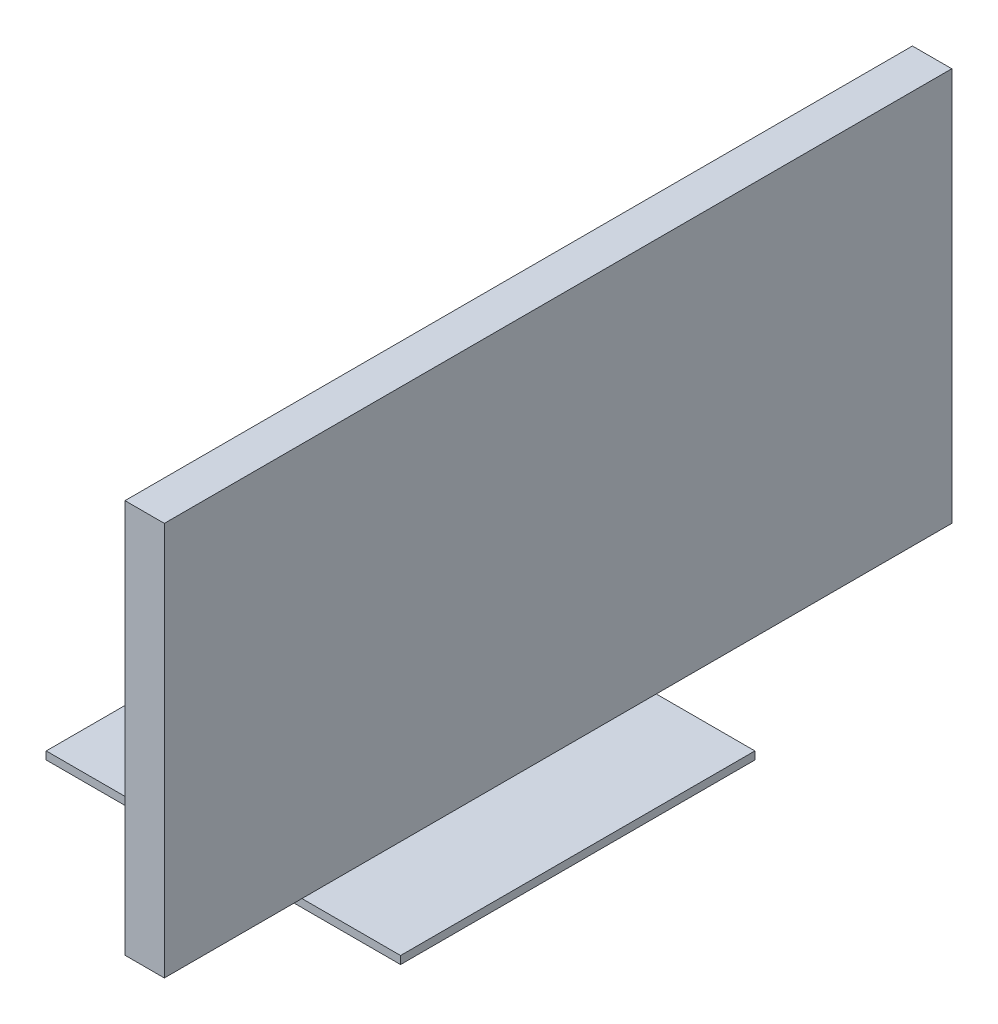
ISO-10303-21;
HEADER;
FILE_DESCRIPTION(('STEP AP214'),'2;1');
FILE_NAME('part.step','',(''),(''),'','','');
FILE_SCHEMA(('AUTOMOTIVE_DESIGN { 1 0 10303 214 1 1 1 1 }'));
ENDSEC;
DATA;
#1=APPLICATION_CONTEXT('core data for automotive mechanical design processes');
#2=APPLICATION_PROTOCOL_DEFINITION('international standard','automotive_design',2000,#1);
#3=PRODUCT_CONTEXT('',#1,'mechanical');
#4=PRODUCT('Part','Part','',(#3));
#5=PRODUCT_RELATED_PRODUCT_CATEGORY('part','',(#4));
#6=PRODUCT_DEFINITION_FORMATION('','',#4);
#7=PRODUCT_DEFINITION_CONTEXT('part definition',#1,'design');
#8=PRODUCT_DEFINITION('design','',#6,#7);
#9=PRODUCT_DEFINITION_SHAPE('','',#8);
#10=(LENGTH_UNIT() NAMED_UNIT(*) SI_UNIT(.MILLI.,.METRE.));
#11=(NAMED_UNIT(*) PLANE_ANGLE_UNIT() SI_UNIT($,.RADIAN.));
#12=(NAMED_UNIT(*) SI_UNIT($,.STERADIAN.) SOLID_ANGLE_UNIT());
#13=UNCERTAINTY_MEASURE_WITH_UNIT(LENGTH_MEASURE(1.E-05),#10,'distance_accuracy_value','');
#14=(GEOMETRIC_REPRESENTATION_CONTEXT(3) GLOBAL_UNCERTAINTY_ASSIGNED_CONTEXT((#13)) GLOBAL_UNIT_ASSIGNED_CONTEXT((#10,
#11,#12)) REPRESENTATION_CONTEXT('',''));
#15=CARTESIAN_POINT('',(0.,0.,0.));
#16=DIRECTION('',(0.,0.,1.));
#17=DIRECTION('',(1.,0.,0.));
#18=AXIS2_PLACEMENT_3D('',#15,#16,#17);
#19=CARTESIAN_POINT('',(0.,1.,0.));
#20=DIRECTION('',(0.,-1.,0.));
#21=DIRECTION('',(0.,0.,-1.));
#22=AXIS2_PLACEMENT_3D('',#19,#20,#21);
#23=PLANE('',#22);
#24=DIRECTION('',(0.,0.,1.));
#25=VECTOR('',#24,1.);
#26=CARTESIAN_POINT('',(0.,1.,0.));
#27=LINE('',#26,#25);
#28=CARTESIAN_POINT('',(0.,1.,-45.));
#29=VERTEX_POINT('',#28);
#30=CARTESIAN_POINT('',(0.,1.,0.));
#31=VERTEX_POINT('',#30);
#32=EDGE_CURVE('E210',#29,#31,#27,.T.);
#33=ORIENTED_EDGE('',*,*,#32,.T.);
#34=DIRECTION('',(1.,0.,0.));
#35=VECTOR('',#34,1.);
#36=CARTESIAN_POINT('',(0.,1.,0.));
#37=LINE('',#36,#35);
#38=CARTESIAN_POINT('',(45.,1.,0.));
#39=VERTEX_POINT('',#38);
#40=EDGE_CURVE('E213',#31,#39,#37,.T.);
#41=ORIENTED_EDGE('',*,*,#40,.T.);
#42=DIRECTION('',(0.,0.,-1.));
#43=VECTOR('',#42,1.);
#44=CARTESIAN_POINT('',(45.,1.,0.));
#45=LINE('',#44,#43);
#46=CARTESIAN_POINT('',(45.,1.,-45.));
#47=VERTEX_POINT('',#46);
#48=EDGE_CURVE('E216',#39,#47,#45,.T.);
#49=ORIENTED_EDGE('',*,*,#48,.T.);
#50=DIRECTION('',(-1.,0.,0.));
#51=VECTOR('',#50,1.);
#52=CARTESIAN_POINT('',(0.,1.,-45.));
#53=LINE('',#52,#51);
#54=EDGE_CURVE('E218',#47,#29,#53,.T.);
#55=ORIENTED_EDGE('',*,*,#54,.T.);
#56=EDGE_LOOP('',(#33,#41,#49,#55));
#57=FACE_BOUND('',#56,.T.);
#58=DIRECTION('',(0.,0.,1.));
#59=VECTOR('',#58,1.);
#60=CARTESIAN_POINT('',(17.5,1.,-27.5));
#61=LINE('',#60,#59);
#62=CARTESIAN_POINT('',(17.5,1.,-27.5));
#63=VERTEX_POINT('',#62);
#64=CARTESIAN_POINT('',(17.5,1.,-17.5));
#65=VERTEX_POINT('',#64);
#66=EDGE_CURVE('E49',#63,#65,#61,.T.);
#67=ORIENTED_EDGE('',*,*,#66,.F.);
#68=DIRECTION('',(1.,0.,0.));
#69=VECTOR('',#68,1.);
#70=CARTESIAN_POINT('',(17.5,1.,-27.5));
#71=LINE('',#70,#69);
#72=CARTESIAN_POINT('',(27.5,1.,-27.5));
#73=VERTEX_POINT('',#72);
#74=EDGE_CURVE('E193',#63,#73,#71,.T.);
#75=ORIENTED_EDGE('',*,*,#74,.T.);
#76=DIRECTION('',(0.,0.,1.));
#77=VECTOR('',#76,1.);
#78=CARTESIAN_POINT('',(27.5,1.,-27.5));
#79=LINE('',#78,#77);
#80=CARTESIAN_POINT('',(27.5,1.,-17.5));
#81=VERTEX_POINT('',#80);
#82=EDGE_CURVE('E198',#73,#81,#79,.T.);
#83=ORIENTED_EDGE('',*,*,#82,.T.);
#84=DIRECTION('',(1.,0.,0.));
#85=VECTOR('',#84,1.);
#86=CARTESIAN_POINT('',(17.5,1.,-17.5));
#87=LINE('',#86,#85);
#88=EDGE_CURVE('E195',#65,#81,#87,.T.);
#89=ORIENTED_EDGE('',*,*,#88,.F.);
#90=EDGE_LOOP('',(#67,#75,#83,#89));
#91=FACE_BOUND('',#90,.T.);
#92=ADVANCED_FACE('F34',(#57,#91),#23,.F.);
#93=CARTESIAN_POINT('',(0.,1.,0.));
#94=DIRECTION('',(1.,0.,0.));
#95=DIRECTION('',(0.,0.,-1.));
#96=AXIS2_PLACEMENT_3D('',#93,#94,#95);
#97=PLANE('',#96);
#98=DIRECTION('',(0.,0.,1.));
#99=VECTOR('',#98,1.);
#100=CARTESIAN_POINT('',(0.,0.,0.));
#101=LINE('',#100,#99);
#102=CARTESIAN_POINT('',(0.,0.,-45.));
#103=VERTEX_POINT('',#102);
#104=CARTESIAN_POINT('',(0.,0.,0.));
#105=VERTEX_POINT('',#104);
#106=EDGE_CURVE('E209',#103,#105,#101,.T.);
#107=ORIENTED_EDGE('',*,*,#106,.T.);
#108=DIRECTION('',(0.,-1.,0.));
#109=VECTOR('',#108,1.);
#110=CARTESIAN_POINT('',(0.,1.,0.));
#111=LINE('',#110,#109);
#112=EDGE_CURVE('E11',#31,#105,#111,.T.);
#113=ORIENTED_EDGE('',*,*,#112,.F.);
#114=ORIENTED_EDGE('',*,*,#32,.F.);
#115=DIRECTION('',(0.,-1.,0.));
#116=VECTOR('',#115,1.);
#117=CARTESIAN_POINT('',(0.,1.,-45.));
#118=LINE('',#117,#116);
#119=EDGE_CURVE('E220',#29,#103,#118,.T.);
#120=ORIENTED_EDGE('',*,*,#119,.T.);
#121=EDGE_LOOP('',(#107,#113,#114,#120));
#122=FACE_BOUND('',#121,.T.);
#123=ADVANCED_FACE('F36',(#122),#97,.F.);
#124=CARTESIAN_POINT('',(0.,1.,0.));
#125=DIRECTION('',(0.,0.,-1.));
#126=DIRECTION('',(-1.,0.,0.));
#127=AXIS2_PLACEMENT_3D('',#124,#125,#126);
#128=PLANE('',#127);
#129=DIRECTION('',(1.,0.,0.));
#130=VECTOR('',#129,1.);
#131=CARTESIAN_POINT('',(0.,0.,0.));
#132=LINE('',#131,#130);
#133=CARTESIAN_POINT('',(45.,0.,0.));
#134=VERTEX_POINT('',#133);
#135=EDGE_CURVE('E223',#105,#134,#132,.T.);
#136=ORIENTED_EDGE('',*,*,#135,.T.);
#137=DIRECTION('',(0.,-1.,0.));
#138=VECTOR('',#137,1.);
#139=CARTESIAN_POINT('',(45.,1.,0.));
#140=LINE('',#139,#138);
#141=EDGE_CURVE('E42',#39,#134,#140,.T.);
#142=ORIENTED_EDGE('',*,*,#141,.F.);
#143=ORIENTED_EDGE('',*,*,#40,.F.);
#144=ORIENTED_EDGE('',*,*,#112,.T.);
#145=EDGE_LOOP('',(#136,#142,#143,#144));
#146=FACE_BOUND('',#145,.T.);
#147=ADVANCED_FACE('F252',(#146),#128,.F.);
#148=CARTESIAN_POINT('',(45.,1.,0.));
#149=DIRECTION('',(-1.,0.,0.));
#150=DIRECTION('',(0.,0.,1.));
#151=AXIS2_PLACEMENT_3D('',#148,#149,#150);
#152=PLANE('',#151);
#153=DIRECTION('',(0.,0.,-1.));
#154=VECTOR('',#153,1.);
#155=CARTESIAN_POINT('',(45.,0.,0.));
#156=LINE('',#155,#154);
#157=CARTESIAN_POINT('',(45.,0.,-45.));
#158=VERTEX_POINT('',#157);
#159=EDGE_CURVE('E225',#134,#158,#156,.T.);
#160=ORIENTED_EDGE('',*,*,#159,.T.);
#161=DIRECTION('',(0.,-1.,0.));
#162=VECTOR('',#161,1.);
#163=CARTESIAN_POINT('',(45.,1.,-45.));
#164=LINE('',#163,#162);
#165=EDGE_CURVE('E230',#47,#158,#164,.T.);
#166=ORIENTED_EDGE('',*,*,#165,.F.);
#167=ORIENTED_EDGE('',*,*,#48,.F.);
#168=ORIENTED_EDGE('',*,*,#141,.T.);
#169=EDGE_LOOP('',(#160,#166,#167,#168));
#170=FACE_BOUND('',#169,.T.);
#171=ADVANCED_FACE('F237',(#170),#152,.F.);
#172=CARTESIAN_POINT('',(0.,1.,-45.));
#173=DIRECTION('',(0.,0.,1.));
#174=DIRECTION('',(1.,0.,0.));
#175=AXIS2_PLACEMENT_3D('',#172,#173,#174);
#176=PLANE('',#175);
#177=DIRECTION('',(-1.,0.,0.));
#178=VECTOR('',#177,1.);
#179=CARTESIAN_POINT('',(0.,0.,-45.));
#180=LINE('',#179,#178);
#181=EDGE_CURVE('E214',#158,#103,#180,.T.);
#182=ORIENTED_EDGE('',*,*,#181,.T.);
#183=ORIENTED_EDGE('',*,*,#119,.F.);
#184=ORIENTED_EDGE('',*,*,#54,.F.);
#185=ORIENTED_EDGE('',*,*,#165,.T.);
#186=EDGE_LOOP('',(#182,#183,#184,#185));
#187=FACE_BOUND('',#186,.T.);
#188=ADVANCED_FACE('F246',(#187),#176,.F.);
#189=CARTESIAN_POINT('',(0.,0.,0.));
#190=DIRECTION('',(0.,-1.,0.));
#191=DIRECTION('',(0.,0.,-1.));
#192=AXIS2_PLACEMENT_3D('',#189,#190,#191);
#193=PLANE('',#192);
#194=ORIENTED_EDGE('',*,*,#106,.F.);
#195=ORIENTED_EDGE('',*,*,#181,.F.);
#196=ORIENTED_EDGE('',*,*,#159,.F.);
#197=ORIENTED_EDGE('',*,*,#135,.F.);
#198=EDGE_LOOP('',(#194,#195,#196,#197));
#199=FACE_BOUND('',#198,.T.);
#200=ADVANCED_FACE('F243',(#199),#193,.T.);
#201=CARTESIAN_POINT('',(17.5,41.,-27.5));
#202=DIRECTION('',(1.,0.,0.));
#203=DIRECTION('',(0.,0.,-1.));
#204=AXIS2_PLACEMENT_3D('',#201,#202,#203);
#205=PLANE('',#204);
#206=ORIENTED_EDGE('',*,*,#66,.T.);
#207=DIRECTION('',(0.,-1.,0.));
#208=VECTOR('',#207,1.);
#209=CARTESIAN_POINT('',(17.5,41.,-17.5));
#210=LINE('',#209,#208);
#211=CARTESIAN_POINT('',(17.5,41.,-17.5));
#212=VERTEX_POINT('',#211);
#213=EDGE_CURVE('E206',#212,#65,#210,.T.);
#214=ORIENTED_EDGE('',*,*,#213,.F.);
#215=DIRECTION('',(0.,0.,1.));
#216=VECTOR('',#215,1.);
#217=CARTESIAN_POINT('',(17.5,41.,-27.5));
#218=LINE('',#217,#216);
#219=CARTESIAN_POINT('',(17.5,41.,-27.5));
#220=VERTEX_POINT('',#219);
#221=EDGE_CURVE('E190',#220,#212,#218,.T.);
#222=ORIENTED_EDGE('',*,*,#221,.F.);
#223=DIRECTION('',(0.,-1.,0.));
#224=VECTOR('',#223,1.);
#225=CARTESIAN_POINT('',(17.5,41.,-27.5));
#226=LINE('',#225,#224);
#227=EDGE_CURVE('E192',#220,#63,#226,.T.);
#228=ORIENTED_EDGE('',*,*,#227,.T.);
#229=EDGE_LOOP('',(#206,#214,#222,#228));
#230=FACE_BOUND('',#229,.T.);
#231=ADVANCED_FACE('F265',(#230),#205,.F.);
#232=CARTESIAN_POINT('',(17.5,41.,-17.5));
#233=DIRECTION('',(0.,0.,-1.));
#234=DIRECTION('',(-1.,0.,0.));
#235=AXIS2_PLACEMENT_3D('',#232,#233,#234);
#236=PLANE('',#235);
#237=DIRECTION('',(0.,-1.,0.));
#238=VECTOR('',#237,1.);
#239=CARTESIAN_POINT('',(27.5,41.,-17.5));
#240=LINE('',#239,#238);
#241=CARTESIAN_POINT('',(27.5,31.0503512242188,-17.5));
#242=VERTEX_POINT('',#241);
#243=EDGE_CURVE('E204',#242,#81,#240,.T.);
#244=ORIENTED_EDGE('',*,*,#243,.F.);
#245=DIRECTION('',(-1.,0.,0.));
#246=VECTOR('',#245,1.);
#247=CARTESIAN_POINT('',(37.5,31.0503512242188,-17.5));
#248=LINE('',#247,#246);
#249=CARTESIAN_POINT('',(37.5,31.0503512242188,-17.5));
#250=VERTEX_POINT('',#249);
#251=EDGE_CURVE('E164',#250,#242,#248,.T.);
#252=ORIENTED_EDGE('',*,*,#251,.F.);
#253=DIRECTION('',(0.,-1.,0.));
#254=VECTOR('',#253,1.);
#255=CARTESIAN_POINT('',(37.5,41.,-17.5));
#256=LINE('',#255,#254);
#257=CARTESIAN_POINT('',(37.5,41.,-17.5));
#258=VERTEX_POINT('',#257);
#259=EDGE_CURVE('E161',#258,#250,#256,.T.);
#260=ORIENTED_EDGE('',*,*,#259,.F.);
#261=DIRECTION('',(1.,0.,0.));
#262=VECTOR('',#261,1.);
#263=CARTESIAN_POINT('',(17.5,41.,-17.5));
#264=LINE('',#263,#262);
#265=EDGE_CURVE('E174',#212,#258,#264,.T.);
#266=ORIENTED_EDGE('',*,*,#265,.F.);
#267=ORIENTED_EDGE('',*,*,#213,.T.);
#268=ORIENTED_EDGE('',*,*,#88,.T.);
#269=EDGE_LOOP('',(#244,#252,#260,#266,#267,#268));
#270=FACE_BOUND('',#269,.T.);
#271=ADVANCED_FACE('F284',(#270),#236,.F.);
#272=CARTESIAN_POINT('',(27.5,41.,-27.5));
#273=DIRECTION('',(1.,0.,0.));
#274=DIRECTION('',(0.,0.,-1.));
#275=AXIS2_PLACEMENT_3D('',#272,#273,#274);
#276=PLANE('',#275);
#277=DIRECTION('',(0.,0.,1.));
#278=VECTOR('',#277,1.);
#279=CARTESIAN_POINT('',(27.5,31.0503512242188,-47.5));
#280=LINE('',#279,#278);
#281=CARTESIAN_POINT('',(27.5,31.0503512242188,-27.5));
#282=VERTEX_POINT('',#281);
#283=EDGE_CURVE('E187',#282,#242,#280,.T.);
#284=ORIENTED_EDGE('',*,*,#283,.T.);
#285=ORIENTED_EDGE('',*,*,#243,.T.);
#286=ORIENTED_EDGE('',*,*,#82,.F.);
#287=DIRECTION('',(0.,-1.,0.));
#288=VECTOR('',#287,1.);
#289=CARTESIAN_POINT('',(27.5,41.,-27.5));
#290=LINE('',#289,#288);
#291=EDGE_CURVE('E57',#282,#73,#290,.T.);
#292=ORIENTED_EDGE('',*,*,#291,.F.);
#293=EDGE_LOOP('',(#284,#285,#286,#292));
#294=FACE_BOUND('',#293,.T.);
#295=ADVANCED_FACE('F292',(#294),#276,.T.);
#296=CARTESIAN_POINT('',(17.5,41.,-27.5));
#297=DIRECTION('',(0.,0.,-1.));
#298=DIRECTION('',(-1.,0.,0.));
#299=AXIS2_PLACEMENT_3D('',#296,#297,#298);
#300=PLANE('',#299);
#301=ORIENTED_EDGE('',*,*,#227,.F.);
#302=DIRECTION('',(1.,0.,0.));
#303=VECTOR('',#302,1.);
#304=CARTESIAN_POINT('',(17.5,41.,-27.5));
#305=LINE('',#304,#303);
#306=CARTESIAN_POINT('',(37.5,41.,-27.5));
#307=VERTEX_POINT('',#306);
#308=EDGE_CURVE('E176',#220,#307,#305,.T.);
#309=ORIENTED_EDGE('',*,*,#308,.T.);
#310=DIRECTION('',(0.,-1.,0.));
#311=VECTOR('',#310,1.);
#312=CARTESIAN_POINT('',(37.5,41.,-27.5));
#313=LINE('',#312,#311);
#314=CARTESIAN_POINT('',(37.5,31.0503512242188,-27.5));
#315=VERTEX_POINT('',#314);
#316=EDGE_CURVE('E170',#307,#315,#313,.T.);
#317=ORIENTED_EDGE('',*,*,#316,.T.);
#318=DIRECTION('',(-1.,0.,0.));
#319=VECTOR('',#318,1.);
#320=CARTESIAN_POINT('',(37.5,31.0503512242188,-27.5));
#321=LINE('',#320,#319);
#322=EDGE_CURVE('E173',#315,#282,#321,.T.);
#323=ORIENTED_EDGE('',*,*,#322,.T.);
#324=ORIENTED_EDGE('',*,*,#291,.T.);
#325=ORIENTED_EDGE('',*,*,#74,.F.);
#326=EDGE_LOOP('',(#301,#309,#317,#323,#324,#325));
#327=FACE_BOUND('',#326,.T.);
#328=ADVANCED_FACE('F299',(#327),#300,.T.);
#329=CARTESIAN_POINT('',(37.5,31.0503512242188,-27.5));
#330=DIRECTION('',(0.,1.,0.));
#331=DIRECTION('',(0.,0.,1.));
#332=AXIS2_PLACEMENT_3D('',#329,#330,#331);
#333=PLANE('',#332);
#334=ORIENTED_EDGE('',*,*,#251,.T.);
#335=ORIENTED_EDGE('',*,*,#283,.F.);
#336=ORIENTED_EDGE('',*,*,#322,.F.);
#337=DIRECTION('',(0.,0.,1.));
#338=VECTOR('',#337,1.);
#339=CARTESIAN_POINT('',(37.5,31.0503512242188,-27.5));
#340=LINE('',#339,#338);
#341=EDGE_CURVE('E184',#315,#250,#340,.T.);
#342=ORIENTED_EDGE('',*,*,#341,.T.);
#343=EDGE_LOOP('',(#334,#335,#336,#342));
#344=FACE_BOUND('',#343,.T.);
#345=ADVANCED_FACE('F306',(#344),#333,.F.);
#346=CARTESIAN_POINT('',(17.5,41.,-27.5));
#347=DIRECTION('',(0.,-1.,0.));
#348=DIRECTION('',(0.,0.,-1.));
#349=AXIS2_PLACEMENT_3D('',#346,#347,#348);
#350=PLANE('',#349);
#351=ORIENTED_EDGE('',*,*,#265,.T.);
#352=DIRECTION('',(0.,0.,1.));
#353=VECTOR('',#352,1.);
#354=CARTESIAN_POINT('',(37.5,41.,-27.5));
#355=LINE('',#354,#353);
#356=EDGE_CURVE('E177',#307,#258,#355,.T.);
#357=ORIENTED_EDGE('',*,*,#356,.F.);
#358=ORIENTED_EDGE('',*,*,#308,.F.);
#359=ORIENTED_EDGE('',*,*,#221,.T.);
#360=EDGE_LOOP('',(#351,#357,#358,#359));
#361=FACE_BOUND('',#360,.T.);
#362=ADVANCED_FACE('F313',(#361),#350,.F.);
#363=CARTESIAN_POINT('',(37.5,0.,0.));
#364=DIRECTION('',(1.,0.,0.));
#365=DIRECTION('',(0.,0.,-1.));
#366=AXIS2_PLACEMENT_3D('',#363,#364,#365);
#367=PLANE('',#366);
#368=DIRECTION('',(0.,0.,-1.));
#369=VECTOR('',#368,1.);
#370=CARTESIAN_POINT('',(37.5,11.0251756121094,27.5));
#371=LINE('',#370,#369);
#372=CARTESIAN_POINT('',(37.5,11.0251756121094,27.5));
#373=VERTEX_POINT('',#372);
#374=CARTESIAN_POINT('',(37.5,11.0251756121094,-72.5));
#375=VERTEX_POINT('',#374);
#376=EDGE_CURVE('E160',#373,#375,#371,.T.);
#377=ORIENTED_EDGE('',*,*,#376,.F.);
#378=DIRECTION('',(0.,1.,0.));
#379=VECTOR('',#378,1.);
#380=CARTESIAN_POINT('',(37.5,11.0251756121094,27.5));
#381=LINE('',#380,#379);
#382=CARTESIAN_POINT('',(37.5,61.0251756121094,27.5));
#383=VERTEX_POINT('',#382);
#384=EDGE_CURVE('E156',#373,#383,#381,.T.);
#385=ORIENTED_EDGE('',*,*,#384,.T.);
#386=DIRECTION('',(0.,0.,-1.));
#387=VECTOR('',#386,1.);
#388=CARTESIAN_POINT('',(37.5,61.0251756121094,27.5));
#389=LINE('',#388,#387);
#390=CARTESIAN_POINT('',(37.5,61.0251756121094,-72.5));
#391=VERTEX_POINT('',#390);
#392=EDGE_CURVE('E423',#383,#391,#389,.T.);
#393=ORIENTED_EDGE('',*,*,#392,.T.);
#394=DIRECTION('',(0.,1.,0.));
#395=VECTOR('',#394,1.);
#396=CARTESIAN_POINT('',(37.5,11.0251756121094,-72.5));
#397=LINE('',#396,#395);
#398=EDGE_CURVE('E425',#375,#391,#397,.T.);
#399=ORIENTED_EDGE('',*,*,#398,.F.);
#400=EDGE_LOOP('',(#377,#385,#393,#399));
#401=FACE_BOUND('',#400,.T.);
#402=ORIENTED_EDGE('',*,*,#356,.T.);
#403=ORIENTED_EDGE('',*,*,#259,.T.);
#404=ORIENTED_EDGE('',*,*,#341,.F.);
#405=ORIENTED_EDGE('',*,*,#316,.F.);
#406=EDGE_LOOP('',(#402,#403,#404,#405));
#407=FACE_BOUND('',#406,.T.);
#408=ADVANCED_FACE('F321',(#401,#407),#367,.F.);
#409=CARTESIAN_POINT('',(42.5,11.0251756121094,27.5));
#410=DIRECTION('',(0.,1.,0.));
#411=DIRECTION('',(0.,0.,1.));
#412=AXIS2_PLACEMENT_3D('',#409,#410,#411);
#413=PLANE('',#412);
#414=ORIENTED_EDGE('',*,*,#376,.T.);
#415=DIRECTION('',(-1.,0.,0.));
#416=VECTOR('',#415,1.);
#417=CARTESIAN_POINT('',(42.5,11.0251756121094,-72.5));
#418=LINE('',#417,#416);
#419=CARTESIAN_POINT('',(42.5,11.0251756121094,-72.5));
#420=VERTEX_POINT('',#419);
#421=EDGE_CURVE('E141',#420,#375,#418,.T.);
#422=ORIENTED_EDGE('',*,*,#421,.F.);
#423=DIRECTION('',(0.,0.,-1.));
#424=VECTOR('',#423,1.);
#425=CARTESIAN_POINT('',(42.5,11.0251756121094,27.5));
#426=LINE('',#425,#424);
#427=CARTESIAN_POINT('',(42.5,11.0251756121094,27.5));
#428=VERTEX_POINT('',#427);
#429=EDGE_CURVE('E148',#428,#420,#426,.T.);
#430=ORIENTED_EDGE('',*,*,#429,.F.);
#431=DIRECTION('',(-1.,0.,0.));
#432=VECTOR('',#431,1.);
#433=CARTESIAN_POINT('',(42.5,11.0251756121094,27.5));
#434=LINE('',#433,#432);
#435=EDGE_CURVE('E420',#428,#373,#434,.T.);
#436=ORIENTED_EDGE('',*,*,#435,.T.);
#437=EDGE_LOOP('',(#414,#422,#430,#436));
#438=FACE_BOUND('',#437,.T.);
#439=ADVANCED_FACE('F158',(#438),#413,.F.);
#440=CARTESIAN_POINT('',(42.5,11.0251756121094,-72.5));
#441=DIRECTION('',(0.,0.,1.));
#442=DIRECTION('',(1.,0.,0.));
#443=AXIS2_PLACEMENT_3D('',#440,#441,#442);
#444=PLANE('',#443);
#445=ORIENTED_EDGE('',*,*,#398,.T.);
#446=DIRECTION('',(-1.,0.,0.));
#447=VECTOR('',#446,1.);
#448=CARTESIAN_POINT('',(42.5,61.0251756121094,-72.5));
#449=LINE('',#448,#447);
#450=CARTESIAN_POINT('',(42.5,61.0251756121094,-72.5));
#451=VERTEX_POINT('',#450);
#452=EDGE_CURVE('E143',#451,#391,#449,.T.);
#453=ORIENTED_EDGE('',*,*,#452,.F.);
#454=DIRECTION('',(0.,1.,0.));
#455=VECTOR('',#454,1.);
#456=CARTESIAN_POINT('',(42.5,11.0251756121094,-72.5));
#457=LINE('',#456,#455);
#458=EDGE_CURVE('E136',#420,#451,#457,.T.);
#459=ORIENTED_EDGE('',*,*,#458,.F.);
#460=ORIENTED_EDGE('',*,*,#421,.T.);
#461=EDGE_LOOP('',(#445,#453,#459,#460));
#462=FACE_BOUND('',#461,.T.);
#463=ADVANCED_FACE('F139',(#462),#444,.F.);
#464=CARTESIAN_POINT('',(42.5,61.0251756121094,27.5));
#465=DIRECTION('',(0.,1.,0.));
#466=DIRECTION('',(0.,0.,1.));
#467=AXIS2_PLACEMENT_3D('',#464,#465,#466);
#468=PLANE('',#467);
#469=ORIENTED_EDGE('',*,*,#392,.F.);
#470=DIRECTION('',(-1.,0.,0.));
#471=VECTOR('',#470,1.);
#472=CARTESIAN_POINT('',(42.5,61.0251756121094,27.5));
#473=LINE('',#472,#471);
#474=CARTESIAN_POINT('',(42.5,61.0251756121094,27.5));
#475=VERTEX_POINT('',#474);
#476=EDGE_CURVE('E166',#475,#383,#473,.T.);
#477=ORIENTED_EDGE('',*,*,#476,.F.);
#478=DIRECTION('',(0.,0.,-1.));
#479=VECTOR('',#478,1.);
#480=CARTESIAN_POINT('',(42.5,61.0251756121094,27.5));
#481=LINE('',#480,#479);
#482=EDGE_CURVE('E147',#475,#451,#481,.T.);
#483=ORIENTED_EDGE('',*,*,#482,.T.);
#484=ORIENTED_EDGE('',*,*,#452,.T.);
#485=EDGE_LOOP('',(#469,#477,#483,#484));
#486=FACE_BOUND('',#485,.T.);
#487=ADVANCED_FACE('F342',(#486),#468,.T.);
#488=CARTESIAN_POINT('',(42.5,11.0251756121094,27.5));
#489=DIRECTION('',(0.,0.,1.));
#490=DIRECTION('',(1.,0.,0.));
#491=AXIS2_PLACEMENT_3D('',#488,#489,#490);
#492=PLANE('',#491);
#493=ORIENTED_EDGE('',*,*,#384,.F.);
#494=ORIENTED_EDGE('',*,*,#435,.F.);
#495=DIRECTION('',(0.,1.,0.));
#496=VECTOR('',#495,1.);
#497=CARTESIAN_POINT('',(42.5,11.0251756121094,27.5));
#498=LINE('',#497,#496);
#499=EDGE_CURVE('E154',#428,#475,#498,.T.);
#500=ORIENTED_EDGE('',*,*,#499,.T.);
#501=ORIENTED_EDGE('',*,*,#476,.T.);
#502=EDGE_LOOP('',(#493,#494,#500,#501));
#503=FACE_BOUND('',#502,.T.);
#504=ADVANCED_FACE('F349',(#503),#492,.T.);
#505=CARTESIAN_POINT('',(42.5,0.,0.));
#506=DIRECTION('',(1.,0.,0.));
#507=DIRECTION('',(0.,0.,-1.));
#508=AXIS2_PLACEMENT_3D('',#505,#506,#507);
#509=PLANE('',#508);
#510=ORIENTED_EDGE('',*,*,#429,.T.);
#511=ORIENTED_EDGE('',*,*,#458,.T.);
#512=ORIENTED_EDGE('',*,*,#482,.F.);
#513=ORIENTED_EDGE('',*,*,#499,.F.);
#514=EDGE_LOOP('',(#510,#511,#512,#513));
#515=FACE_BOUND('',#514,.T.);
#516=ADVANCED_FACE('F152',(#515),#509,.T.);
#517=CLOSED_SHELL('',(#92,#123,#147,#171,#188,#200,#231,#271,#295,#328,#345,#362,#408,#439,#463,
#487,#504,#516));
#518=MANIFOLD_SOLID_BREP('B2',#517);
#519=ADVANCED_BREP_SHAPE_REPRESENTATION('',(#18,#518),#14);
#520=SHAPE_DEFINITION_REPRESENTATION(#9,#519);
ENDSEC;
END-ISO-10303-21;
